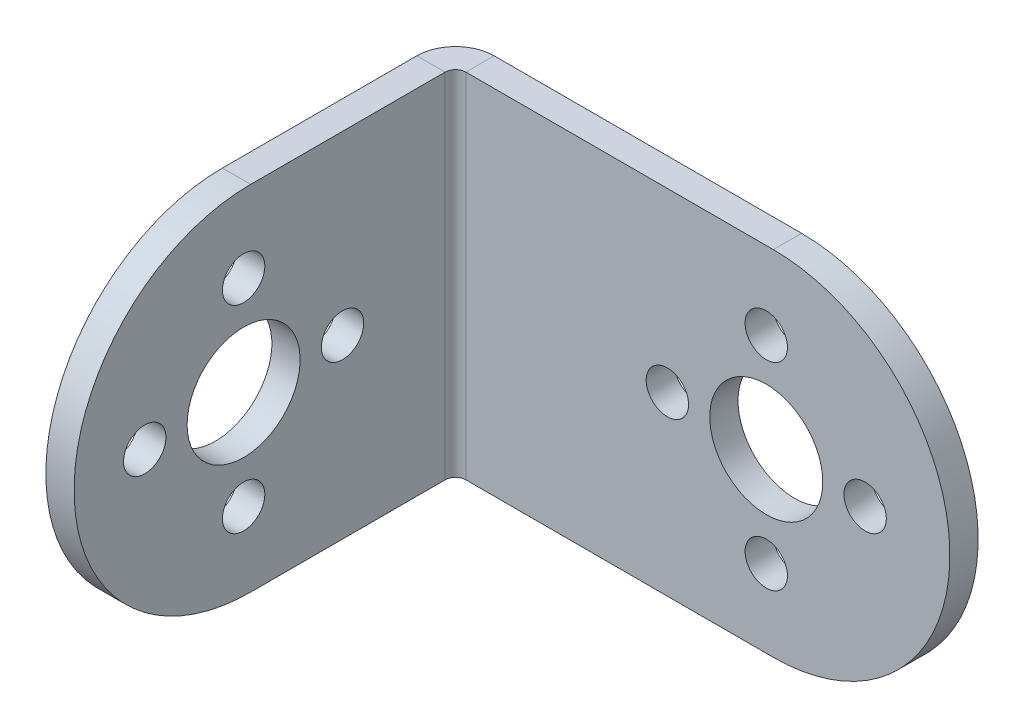
ISO-10303-21;
HEADER;
FILE_DESCRIPTION(('STEP AP214'),'2;1');
FILE_NAME('part.step','',(''),(''),'','','');
FILE_SCHEMA(('AUTOMOTIVE_DESIGN { 1 0 10303 214 1 1 1 1 }'));
ENDSEC;
DATA;
#1=APPLICATION_CONTEXT('core data for automotive mechanical design processes');
#2=APPLICATION_PROTOCOL_DEFINITION('international standard','automotive_design',2000,#1);
#3=PRODUCT_CONTEXT('',#1,'mechanical');
#4=PRODUCT('Part','Part','',(#3));
#5=PRODUCT_RELATED_PRODUCT_CATEGORY('part','',(#4));
#6=PRODUCT_DEFINITION_FORMATION('','',#4);
#7=PRODUCT_DEFINITION_CONTEXT('part definition',#1,'design');
#8=PRODUCT_DEFINITION('design','',#6,#7);
#9=PRODUCT_DEFINITION_SHAPE('','',#8);
#10=(LENGTH_UNIT() NAMED_UNIT(*) SI_UNIT(.MILLI.,.METRE.));
#11=(NAMED_UNIT(*) PLANE_ANGLE_UNIT() SI_UNIT($,.RADIAN.));
#12=(NAMED_UNIT(*) SI_UNIT($,.STERADIAN.) SOLID_ANGLE_UNIT());
#13=UNCERTAINTY_MEASURE_WITH_UNIT(LENGTH_MEASURE(1.E-05),#10,'distance_accuracy_value','');
#14=(GEOMETRIC_REPRESENTATION_CONTEXT(3) GLOBAL_UNCERTAINTY_ASSIGNED_CONTEXT((#13)) GLOBAL_UNIT_ASSIGNED_CONTEXT((#10,
#11,#12)) REPRESENTATION_CONTEXT('',''));
#15=CARTESIAN_POINT('',(0.,0.,0.));
#16=DIRECTION('',(0.,0.,1.));
#17=DIRECTION('',(1.,0.,0.));
#18=AXIS2_PLACEMENT_3D('',#15,#16,#17);
#19=CARTESIAN_POINT('',(0.,0.,0.));
#20=DIRECTION('',(-1.,0.,0.));
#21=DIRECTION('',(0.,0.,1.));
#22=AXIS2_PLACEMENT_3D('',#19,#20,#21);
#23=PLANE('',#22);
#24=CARTESIAN_POINT('',(0.,-5.5,15.));
#25=DIRECTION('',(-1.,0.,0.));
#26=DIRECTION('',(0.,0.,1.));
#27=AXIS2_PLACEMENT_3D('',#24,#25,#26);
#28=CIRCLE('',#27,1.5);
#29=CARTESIAN_POINT('',(0.,-5.5,16.5));
#30=VERTEX_POINT('',#29);
#31=EDGE_CURVE('E135',#30,#30,#28,.T.);
#32=ORIENTED_EDGE('',*,*,#31,.F.);
#33=EDGE_LOOP('',(#32));
#34=FACE_BOUND('',#33,.T.);
#35=CARTESIAN_POINT('',(0.,-12.5,7.99999999999999));
#36=DIRECTION('',(-1.,0.,0.));
#37=DIRECTION('',(0.,0.,1.));
#38=AXIS2_PLACEMENT_3D('',#35,#36,#37);
#39=CIRCLE('',#38,1.5);
#40=CARTESIAN_POINT('',(0.,-12.5,9.49999999999999));
#41=VERTEX_POINT('',#40);
#42=EDGE_CURVE('E531',#41,#41,#39,.T.);
#43=ORIENTED_EDGE('',*,*,#42,.F.);
#44=EDGE_LOOP('',(#43));
#45=FACE_BOUND('',#44,.T.);
#46=CARTESIAN_POINT('',(0.,-12.5,15.));
#47=DIRECTION('',(-1.,0.,0.));
#48=DIRECTION('',(0.,0.,1.));
#49=AXIS2_PLACEMENT_3D('',#46,#47,#48);
#50=CIRCLE('',#49,4.);
#51=CARTESIAN_POINT('',(0.,-12.5,19.));
#52=VERTEX_POINT('',#51);
#53=EDGE_CURVE('E147',#52,#52,#50,.T.);
#54=ORIENTED_EDGE('',*,*,#53,.F.);
#55=EDGE_LOOP('',(#54));
#56=FACE_BOUND('',#55,.T.);
#57=CARTESIAN_POINT('',(0.,-12.5,22.));
#58=DIRECTION('',(-1.,0.,0.));
#59=DIRECTION('',(0.,0.,1.));
#60=AXIS2_PLACEMENT_3D('',#57,#58,#59);
#61=CIRCLE('',#60,1.5);
#62=CARTESIAN_POINT('',(0.,-12.5,23.5));
#63=VERTEX_POINT('',#62);
#64=EDGE_CURVE('E537',#63,#63,#61,.T.);
#65=ORIENTED_EDGE('',*,*,#64,.F.);
#66=EDGE_LOOP('',(#65));
#67=FACE_BOUND('',#66,.T.);
#68=CARTESIAN_POINT('',(0.,-19.5,15.));
#69=DIRECTION('',(-1.,0.,0.));
#70=DIRECTION('',(0.,0.,1.));
#71=AXIS2_PLACEMENT_3D('',#68,#69,#70);
#72=CIRCLE('',#71,1.5);
#73=CARTESIAN_POINT('',(0.,-19.5,16.5));
#74=VERTEX_POINT('',#73);
#75=EDGE_CURVE('E524',#74,#74,#72,.T.);
#76=ORIENTED_EDGE('',*,*,#75,.F.);
#77=EDGE_LOOP('',(#76));
#78=FACE_BOUND('',#77,.T.);
#79=DIRECTION('',(0.,0.,-1.));
#80=VECTOR('',#79,1.);
#81=CARTESIAN_POINT('',(0.,-25.,0.));
#82=LINE('',#81,#80);
#83=CARTESIAN_POINT('',(0.,-25.,14.5));
#84=VERTEX_POINT('',#83);
#85=CARTESIAN_POINT('',(0.,-25.,0.73659999999999));
#86=VERTEX_POINT('',#85);
#87=EDGE_CURVE('E132',#84,#86,#82,.T.);
#88=ORIENTED_EDGE('',*,*,#87,.F.);
#89=CARTESIAN_POINT('',(0.,-12.5,14.5));
#90=DIRECTION('',(-1.,0.,0.));
#91=DIRECTION('',(0.,0.,1.));
#92=AXIS2_PLACEMENT_3D('',#89,#90,#91);
#93=CIRCLE('',#92,12.5);
#94=CARTESIAN_POINT('',(0.,0.,14.5));
#95=VERTEX_POINT('',#94);
#96=EDGE_CURVE('E118',#95,#84,#93,.F.);
#97=ORIENTED_EDGE('',*,*,#96,.F.);
#98=DIRECTION('',(0.,0.,1.));
#99=VECTOR('',#98,1.);
#100=CARTESIAN_POINT('',(0.,0.,28.));
#101=LINE('',#100,#99);
#102=CARTESIAN_POINT('',(0.,0.,0.73659999999999));
#103=VERTEX_POINT('',#102);
#104=EDGE_CURVE('E140',#103,#95,#101,.T.);
#105=ORIENTED_EDGE('',*,*,#104,.F.);
#106=DIRECTION('',(0.,-1.,0.));
#107=VECTOR('',#106,1.);
#108=CARTESIAN_POINT('',(0.,0.,0.73659999999999));
#109=LINE('',#108,#107);
#110=EDGE_CURVE('E138',#103,#86,#109,.T.);
#111=ORIENTED_EDGE('',*,*,#110,.T.);
#112=EDGE_LOOP('',(#88,#97,#105,#111));
#113=FACE_BOUND('',#112,.T.);
#114=ADVANCED_FACE('F56',(#34,#45,#56,#67,#78,#113),#23,.T.);
#115=CARTESIAN_POINT('',(2.,0.,0.));
#116=DIRECTION('',(-1.,0.,0.));
#117=DIRECTION('',(0.,0.,1.));
#118=AXIS2_PLACEMENT_3D('',#115,#116,#117);
#119=PLANE('',#118);
#120=CARTESIAN_POINT('',(1.99999999999995,-5.5,15.));
#121=DIRECTION('',(-1.,0.,0.));
#122=DIRECTION('',(0.,0.,1.));
#123=AXIS2_PLACEMENT_3D('',#120,#121,#122);
#124=CIRCLE('',#123,1.5);
#125=CARTESIAN_POINT('',(1.99999999999994,-5.5,16.5));
#126=VERTEX_POINT('',#125);
#127=EDGE_CURVE('E521',#126,#126,#124,.T.);
#128=ORIENTED_EDGE('',*,*,#127,.T.);
#129=EDGE_LOOP('',(#128));
#130=FACE_BOUND('',#129,.T.);
#131=CARTESIAN_POINT('',(1.99999999999997,-12.5,8.));
#132=DIRECTION('',(-1.,0.,0.));
#133=DIRECTION('',(0.,0.,1.));
#134=AXIS2_PLACEMENT_3D('',#131,#132,#133);
#135=CIRCLE('',#134,1.5);
#136=CARTESIAN_POINT('',(1.99999999999997,-12.5,9.5));
#137=VERTEX_POINT('',#136);
#138=EDGE_CURVE('E534',#137,#137,#135,.T.);
#139=ORIENTED_EDGE('',*,*,#138,.T.);
#140=EDGE_LOOP('',(#139));
#141=FACE_BOUND('',#140,.T.);
#142=CARTESIAN_POINT('',(1.99999999999995,-12.5,15.));
#143=DIRECTION('',(-1.,0.,0.));
#144=DIRECTION('',(0.,0.,1.));
#145=AXIS2_PLACEMENT_3D('',#142,#143,#144);
#146=CIRCLE('',#145,4.);
#147=CARTESIAN_POINT('',(1.99999999999993,-12.5,19.));
#148=VERTEX_POINT('',#147);
#149=EDGE_CURVE('E164',#148,#148,#146,.T.);
#150=ORIENTED_EDGE('',*,*,#149,.T.);
#151=EDGE_LOOP('',(#150));
#152=FACE_BOUND('',#151,.T.);
#153=CARTESIAN_POINT('',(1.99999999999992,-12.5,22.));
#154=DIRECTION('',(-1.,0.,0.));
#155=DIRECTION('',(0.,0.,1.));
#156=AXIS2_PLACEMENT_3D('',#153,#154,#155);
#157=CIRCLE('',#156,1.5);
#158=CARTESIAN_POINT('',(1.99999999999992,-12.5,23.5));
#159=VERTEX_POINT('',#158);
#160=EDGE_CURVE('E540',#159,#159,#157,.T.);
#161=ORIENTED_EDGE('',*,*,#160,.T.);
#162=EDGE_LOOP('',(#161));
#163=FACE_BOUND('',#162,.T.);
#164=CARTESIAN_POINT('',(1.99999999999995,-19.5,15.));
#165=DIRECTION('',(-1.,0.,0.));
#166=DIRECTION('',(0.,0.,1.));
#167=AXIS2_PLACEMENT_3D('',#164,#165,#166);
#168=CIRCLE('',#167,1.5);
#169=CARTESIAN_POINT('',(1.99999999999994,-19.5,16.5));
#170=VERTEX_POINT('',#169);
#171=EDGE_CURVE('E528',#170,#170,#168,.T.);
#172=ORIENTED_EDGE('',*,*,#171,.T.);
#173=EDGE_LOOP('',(#172));
#174=FACE_BOUND('',#173,.T.);
#175=CARTESIAN_POINT('',(1.99999999999995,-12.5,14.5));
#176=DIRECTION('',(-1.,0.,0.));
#177=DIRECTION('',(0.,0.,1.));
#178=AXIS2_PLACEMENT_3D('',#175,#176,#177);
#179=CIRCLE('',#178,12.5);
#180=CARTESIAN_POINT('',(1.99999999999995,0.,14.5));
#181=VERTEX_POINT('',#180);
#182=CARTESIAN_POINT('',(1.99999999999995,-25.,14.5));
#183=VERTEX_POINT('',#182);
#184=EDGE_CURVE('E71',#181,#183,#179,.F.);
#185=ORIENTED_EDGE('',*,*,#184,.T.);
#186=DIRECTION('',(0.,0.,1.));
#187=VECTOR('',#186,1.);
#188=CARTESIAN_POINT('',(2.,-25.,0.));
#189=LINE('',#188,#187);
#190=CARTESIAN_POINT('',(2.,-25.,0.736599999999997));
#191=VERTEX_POINT('',#190);
#192=EDGE_CURVE('E134',#183,#191,#189,.F.);
#193=ORIENTED_EDGE('',*,*,#192,.T.);
#194=DIRECTION('',(0.,1.,0.));
#195=VECTOR('',#194,1.);
#196=CARTESIAN_POINT('',(2.,0.,0.736599999999997));
#197=LINE('',#196,#195);
#198=CARTESIAN_POINT('',(2.,0.,0.736599999999997));
#199=VERTEX_POINT('',#198);
#200=EDGE_CURVE('E158',#199,#191,#197,.F.);
#201=ORIENTED_EDGE('',*,*,#200,.F.);
#202=DIRECTION('',(0.,0.,-1.));
#203=VECTOR('',#202,1.);
#204=CARTESIAN_POINT('',(2.,0.,0.));
#205=LINE('',#204,#203);
#206=EDGE_CURVE('E151',#199,#181,#205,.F.);
#207=ORIENTED_EDGE('',*,*,#206,.T.);
#208=EDGE_LOOP('',(#185,#193,#201,#207));
#209=FACE_BOUND('',#208,.T.);
#210=ADVANCED_FACE('F259',(#130,#141,#152,#163,#174,#209),#119,.F.);
#211=CARTESIAN_POINT('',(0.,-25.,0.));
#212=DIRECTION('',(0.,-1.,0.));
#213=DIRECTION('',(0.,0.,-1.));
#214=AXIS2_PLACEMENT_3D('',#211,#212,#213);
#215=PLANE('',#214);
#216=ORIENTED_EDGE('',*,*,#192,.F.);
#217=DIRECTION('',(1.,0.,0.));
#218=VECTOR('',#217,1.);
#219=CARTESIAN_POINT('',(1.99999999999995,-25.,14.5));
#220=LINE('',#219,#218);
#221=EDGE_CURVE('E121',#183,#84,#220,.F.);
#222=ORIENTED_EDGE('',*,*,#221,.T.);
#223=ORIENTED_EDGE('',*,*,#87,.T.);
#224=DIRECTION('',(-1.,0.,0.));
#225=VECTOR('',#224,1.);
#226=CARTESIAN_POINT('',(2.,-25.,0.736599999999997));
#227=LINE('',#226,#225);
#228=EDGE_CURVE('E155',#191,#86,#227,.T.);
#229=ORIENTED_EDGE('',*,*,#228,.F.);
#230=EDGE_LOOP('',(#216,#222,#223,#229));
#231=FACE_BOUND('',#230,.T.);
#232=ADVANCED_FACE('F130',(#231),#215,.T.);
#233=CARTESIAN_POINT('',(0.,-25.,-2.));
#234=DIRECTION('',(0.,-1.,0.));
#235=DIRECTION('',(1.,0.,0.));
#236=AXIS2_PLACEMENT_3D('',#233,#234,#235);
#237=PLANE('',#236);
#238=DIRECTION('',(1.,0.,0.));
#239=VECTOR('',#238,1.);
#240=CARTESIAN_POINT('',(0.,-25.,0.));
#241=LINE('',#240,#239);
#242=CARTESIAN_POINT('',(2.7366,-25.,0.));
#243=VERTEX_POINT('',#242);
#244=CARTESIAN_POINT('',(24.5,-25.,0.));
#245=VERTEX_POINT('',#244);
#246=EDGE_CURVE('E223',#243,#245,#241,.T.);
#247=ORIENTED_EDGE('',*,*,#246,.F.);
#248=DIRECTION('',(0.,0.,-1.));
#249=VECTOR('',#248,1.);
#250=CARTESIAN_POINT('',(2.7366,-25.,0.));
#251=LINE('',#250,#249);
#252=CARTESIAN_POINT('',(2.7366,-25.,-2.));
#253=VERTEX_POINT('',#252);
#254=EDGE_CURVE('E170',#243,#253,#251,.T.);
#255=ORIENTED_EDGE('',*,*,#254,.T.);
#256=DIRECTION('',(1.,0.,0.));
#257=VECTOR('',#256,1.);
#258=CARTESIAN_POINT('',(0.,-25.,-2.));
#259=LINE('',#258,#257);
#260=CARTESIAN_POINT('',(24.5,-25.,-2.));
#261=VERTEX_POINT('',#260);
#262=EDGE_CURVE('E215',#253,#261,#259,.T.);
#263=ORIENTED_EDGE('',*,*,#262,.T.);
#264=DIRECTION('',(0.,0.,1.));
#265=VECTOR('',#264,1.);
#266=CARTESIAN_POINT('',(24.5,-25.,-2.));
#267=LINE('',#266,#265);
#268=EDGE_CURVE('E60',#261,#245,#267,.T.);
#269=ORIENTED_EDGE('',*,*,#268,.T.);
#270=EDGE_LOOP('',(#247,#255,#263,#269));
#271=FACE_BOUND('',#270,.T.);
#272=ADVANCED_FACE('F251',(#271),#237,.T.);
#273=CARTESIAN_POINT('',(24.5,-12.5,-2.));
#274=DIRECTION('',(0.,0.,-1.));
#275=DIRECTION('',(-1.,0.,0.));
#276=AXIS2_PLACEMENT_3D('',#273,#274,#275);
#277=PLANE('',#276);
#278=CARTESIAN_POINT('',(24.,-12.5,-2.));
#279=DIRECTION('',(0.,0.,1.));
#280=DIRECTION('',(1.,0.,0.));
#281=AXIS2_PLACEMENT_3D('',#278,#279,#280);
#282=CIRCLE('',#281,4.);
#283=CARTESIAN_POINT('',(28.,-12.5,-2.));
#284=VERTEX_POINT('',#283);
#285=EDGE_CURVE('E206',#284,#284,#282,.T.);
#286=ORIENTED_EDGE('',*,*,#285,.T.);
#287=EDGE_LOOP('',(#286));
#288=FACE_BOUND('',#287,.T.);
#289=CARTESIAN_POINT('',(17.,-12.5,-2.));
#290=DIRECTION('',(0.,0.,1.));
#291=DIRECTION('',(1.,0.,0.));
#292=AXIS2_PLACEMENT_3D('',#289,#290,#291);
#293=CIRCLE('',#292,1.5);
#294=CARTESIAN_POINT('',(18.5,-12.5,-2.));
#295=VERTEX_POINT('',#294);
#296=EDGE_CURVE('E200',#295,#295,#293,.T.);
#297=ORIENTED_EDGE('',*,*,#296,.T.);
#298=EDGE_LOOP('',(#297));
#299=FACE_BOUND('',#298,.T.);
#300=CARTESIAN_POINT('',(31.,-12.5,-2.));
#301=DIRECTION('',(0.,0.,1.));
#302=DIRECTION('',(1.,0.,0.));
#303=AXIS2_PLACEMENT_3D('',#300,#301,#302);
#304=CIRCLE('',#303,1.5);
#305=CARTESIAN_POINT('',(32.5,-12.5,-2.));
#306=VERTEX_POINT('',#305);
#307=EDGE_CURVE('E194',#306,#306,#304,.T.);
#308=ORIENTED_EDGE('',*,*,#307,.T.);
#309=EDGE_LOOP('',(#308));
#310=FACE_BOUND('',#309,.T.);
#311=CARTESIAN_POINT('',(24.,-19.5,-2.));
#312=DIRECTION('',(0.,0.,1.));
#313=DIRECTION('',(1.,0.,0.));
#314=AXIS2_PLACEMENT_3D('',#311,#312,#313);
#315=CIRCLE('',#314,1.5);
#316=CARTESIAN_POINT('',(25.5,-19.5,-2.));
#317=VERTEX_POINT('',#316);
#318=EDGE_CURVE('E188',#317,#317,#315,.T.);
#319=ORIENTED_EDGE('',*,*,#318,.T.);
#320=EDGE_LOOP('',(#319));
#321=FACE_BOUND('',#320,.T.);
#322=CARTESIAN_POINT('',(24.,-5.5,-2.));
#323=DIRECTION('',(0.,0.,1.));
#324=DIRECTION('',(1.,0.,0.));
#325=AXIS2_PLACEMENT_3D('',#322,#323,#324);
#326=CIRCLE('',#325,1.5);
#327=CARTESIAN_POINT('',(25.5,-5.5,-2.));
#328=VERTEX_POINT('',#327);
#329=EDGE_CURVE('E182',#328,#328,#326,.T.);
#330=ORIENTED_EDGE('',*,*,#329,.T.);
#331=EDGE_LOOP('',(#330));
#332=FACE_BOUND('',#331,.T.);
#333=ORIENTED_EDGE('',*,*,#262,.F.);
#334=DIRECTION('',(0.,-1.,0.));
#335=VECTOR('',#334,1.);
#336=CARTESIAN_POINT('',(2.7366,-25.,-2.));
#337=LINE('',#336,#335);
#338=CARTESIAN_POINT('',(2.7366,0.,-2.));
#339=VERTEX_POINT('',#338);
#340=EDGE_CURVE('E165',#253,#339,#337,.F.);
#341=ORIENTED_EDGE('',*,*,#340,.T.);
#342=DIRECTION('',(-1.,0.,0.));
#343=VECTOR('',#342,1.);
#344=CARTESIAN_POINT('',(0.,0.,-2.));
#345=LINE('',#344,#343);
#346=CARTESIAN_POINT('',(24.5,0.,-2.));
#347=VERTEX_POINT('',#346);
#348=EDGE_CURVE('E212',#347,#339,#345,.T.);
#349=ORIENTED_EDGE('',*,*,#348,.F.);
#350=CARTESIAN_POINT('',(24.5,-12.5,-2.));
#351=DIRECTION('',(0.,0.,1.));
#352=DIRECTION('',(-1.,0.,0.));
#353=AXIS2_PLACEMENT_3D('',#350,#351,#352);
#354=CIRCLE('',#353,12.5);
#355=EDGE_CURVE('E218',#261,#347,#354,.T.);
#356=ORIENTED_EDGE('',*,*,#355,.F.);
#357=EDGE_LOOP('',(#333,#341,#349,#356));
#358=FACE_BOUND('',#357,.T.);
#359=ADVANCED_FACE('F245',(#288,#299,#310,#321,#332,#358),#277,.T.);
#360=CARTESIAN_POINT('',(24.5,-12.5,0.));
#361=DIRECTION('',(0.,0.,-1.));
#362=DIRECTION('',(-1.,0.,0.));
#363=AXIS2_PLACEMENT_3D('',#360,#361,#362);
#364=PLANE('',#363);
#365=CARTESIAN_POINT('',(24.,-12.5,0.));
#366=DIRECTION('',(0.,0.,1.));
#367=DIRECTION('',(1.,0.,0.));
#368=AXIS2_PLACEMENT_3D('',#365,#366,#367);
#369=CIRCLE('',#368,4.);
#370=CARTESIAN_POINT('',(28.,-12.5,0.));
#371=VERTEX_POINT('',#370);
#372=EDGE_CURVE('E203',#371,#371,#369,.T.);
#373=ORIENTED_EDGE('',*,*,#372,.F.);
#374=EDGE_LOOP('',(#373));
#375=FACE_BOUND('',#374,.T.);
#376=CARTESIAN_POINT('',(17.,-12.5,0.));
#377=DIRECTION('',(0.,0.,1.));
#378=DIRECTION('',(1.,0.,0.));
#379=AXIS2_PLACEMENT_3D('',#376,#377,#378);
#380=CIRCLE('',#379,1.5);
#381=CARTESIAN_POINT('',(18.5,-12.5,0.));
#382=VERTEX_POINT('',#381);
#383=EDGE_CURVE('E197',#382,#382,#380,.T.);
#384=ORIENTED_EDGE('',*,*,#383,.F.);
#385=EDGE_LOOP('',(#384));
#386=FACE_BOUND('',#385,.T.);
#387=CARTESIAN_POINT('',(31.,-12.5,0.));
#388=DIRECTION('',(0.,0.,1.));
#389=DIRECTION('',(1.,0.,0.));
#390=AXIS2_PLACEMENT_3D('',#387,#388,#389);
#391=CIRCLE('',#390,1.5);
#392=CARTESIAN_POINT('',(32.5,-12.5,0.));
#393=VERTEX_POINT('',#392);
#394=EDGE_CURVE('E191',#393,#393,#391,.T.);
#395=ORIENTED_EDGE('',*,*,#394,.F.);
#396=EDGE_LOOP('',(#395));
#397=FACE_BOUND('',#396,.T.);
#398=CARTESIAN_POINT('',(24.,-19.5,0.));
#399=DIRECTION('',(0.,0.,1.));
#400=DIRECTION('',(1.,0.,0.));
#401=AXIS2_PLACEMENT_3D('',#398,#399,#400);
#402=CIRCLE('',#401,1.5);
#403=CARTESIAN_POINT('',(25.5,-19.5,0.));
#404=VERTEX_POINT('',#403);
#405=EDGE_CURVE('E185',#404,#404,#402,.T.);
#406=ORIENTED_EDGE('',*,*,#405,.F.);
#407=EDGE_LOOP('',(#406));
#408=FACE_BOUND('',#407,.T.);
#409=CARTESIAN_POINT('',(24.,-5.5,0.));
#410=DIRECTION('',(0.,0.,1.));
#411=DIRECTION('',(1.,0.,0.));
#412=AXIS2_PLACEMENT_3D('',#409,#410,#411);
#413=CIRCLE('',#412,1.5);
#414=CARTESIAN_POINT('',(25.5,-5.5,0.));
#415=VERTEX_POINT('',#414);
#416=EDGE_CURVE('E179',#415,#415,#413,.T.);
#417=ORIENTED_EDGE('',*,*,#416,.F.);
#418=EDGE_LOOP('',(#417));
#419=FACE_BOUND('',#418,.T.);
#420=DIRECTION('',(0.,-1.,0.));
#421=VECTOR('',#420,1.);
#422=CARTESIAN_POINT('',(2.7366,-25.,0.));
#423=LINE('',#422,#421);
#424=CARTESIAN_POINT('',(2.7366,0.,0.));
#425=VERTEX_POINT('',#424);
#426=EDGE_CURVE('E143',#243,#425,#423,.F.);
#427=ORIENTED_EDGE('',*,*,#426,.F.);
#428=ORIENTED_EDGE('',*,*,#246,.T.);
#429=CARTESIAN_POINT('',(24.5,-12.5,0.));
#430=DIRECTION('',(0.,0.,1.));
#431=DIRECTION('',(-1.,0.,0.));
#432=AXIS2_PLACEMENT_3D('',#429,#430,#431);
#433=CIRCLE('',#432,12.5);
#434=CARTESIAN_POINT('',(24.5,0.,0.));
#435=VERTEX_POINT('',#434);
#436=EDGE_CURVE('E216',#245,#435,#433,.T.);
#437=ORIENTED_EDGE('',*,*,#436,.T.);
#438=DIRECTION('',(-1.,0.,0.));
#439=VECTOR('',#438,1.);
#440=CARTESIAN_POINT('',(0.,0.,0.));
#441=LINE('',#440,#439);
#442=EDGE_CURVE('E209',#435,#425,#441,.T.);
#443=ORIENTED_EDGE('',*,*,#442,.T.);
#444=EDGE_LOOP('',(#427,#428,#437,#443));
#445=FACE_BOUND('',#444,.T.);
#446=ADVANCED_FACE('F229',(#375,#386,#397,#408,#419,#445),#364,.F.);
#447=CARTESIAN_POINT('',(0.,0.,-2.));
#448=DIRECTION('',(0.,1.,0.));
#449=DIRECTION('',(0.,0.,1.));
#450=AXIS2_PLACEMENT_3D('',#447,#448,#449);
#451=PLANE('',#450);
#452=DIRECTION('',(0.,0.,-1.));
#453=VECTOR('',#452,1.);
#454=CARTESIAN_POINT('',(2.7366,0.,0.));
#455=LINE('',#454,#453);
#456=EDGE_CURVE('E177',#425,#339,#455,.T.);
#457=ORIENTED_EDGE('',*,*,#456,.F.);
#458=ORIENTED_EDGE('',*,*,#442,.F.);
#459=DIRECTION('',(0.,0.,1.));
#460=VECTOR('',#459,1.);
#461=CARTESIAN_POINT('',(24.5,0.,-2.));
#462=LINE('',#461,#460);
#463=EDGE_CURVE('E13',#347,#435,#462,.T.);
#464=ORIENTED_EDGE('',*,*,#463,.F.);
#465=ORIENTED_EDGE('',*,*,#348,.T.);
#466=EDGE_LOOP('',(#457,#458,#464,#465));
#467=FACE_BOUND('',#466,.T.);
#468=ADVANCED_FACE('F58',(#467),#451,.T.);
#469=CARTESIAN_POINT('',(24.5,-12.5,-2.));
#470=DIRECTION('',(0.,0.,1.));
#471=DIRECTION('',(1.,0.,0.));
#472=AXIS2_PLACEMENT_3D('',#469,#470,#471);
#473=CYLINDRICAL_SURFACE('',#472,12.5);
#474=ORIENTED_EDGE('',*,*,#436,.F.);
#475=ORIENTED_EDGE('',*,*,#268,.F.);
#476=ORIENTED_EDGE('',*,*,#355,.T.);
#477=ORIENTED_EDGE('',*,*,#463,.T.);
#478=EDGE_LOOP('',(#474,#475,#476,#477));
#479=FACE_BOUND('',#478,.T.);
#480=ADVANCED_FACE('F236',(#479),#473,.T.);
#481=CARTESIAN_POINT('',(24.,-12.5,-2.));
#482=DIRECTION('',(0.,0.,1.));
#483=DIRECTION('',(1.,0.,0.));
#484=AXIS2_PLACEMENT_3D('',#481,#482,#483);
#485=CYLINDRICAL_SURFACE('',#484,4.);
#486=ORIENTED_EDGE('',*,*,#285,.F.);
#487=EDGE_LOOP('',(#486));
#488=FACE_BOUND('',#487,.T.);
#489=ORIENTED_EDGE('',*,*,#372,.T.);
#490=EDGE_LOOP('',(#489));
#491=FACE_BOUND('',#490,.T.);
#492=ADVANCED_FACE('F305',(#488,#491),#485,.F.);
#493=CARTESIAN_POINT('',(17.,-12.5,-2.));
#494=DIRECTION('',(0.,0.,1.));
#495=DIRECTION('',(1.,0.,0.));
#496=AXIS2_PLACEMENT_3D('',#493,#494,#495);
#497=CYLINDRICAL_SURFACE('',#496,1.5);
#498=ORIENTED_EDGE('',*,*,#296,.F.);
#499=EDGE_LOOP('',(#498));
#500=FACE_BOUND('',#499,.T.);
#501=ORIENTED_EDGE('',*,*,#383,.T.);
#502=EDGE_LOOP('',(#501));
#503=FACE_BOUND('',#502,.T.);
#504=ADVANCED_FACE('F301',(#500,#503),#497,.F.);
#505=CARTESIAN_POINT('',(31.,-12.5,-2.));
#506=DIRECTION('',(0.,0.,1.));
#507=DIRECTION('',(1.,0.,0.));
#508=AXIS2_PLACEMENT_3D('',#505,#506,#507);
#509=CYLINDRICAL_SURFACE('',#508,1.5);
#510=ORIENTED_EDGE('',*,*,#307,.F.);
#511=EDGE_LOOP('',(#510));
#512=FACE_BOUND('',#511,.T.);
#513=ORIENTED_EDGE('',*,*,#394,.T.);
#514=EDGE_LOOP('',(#513));
#515=FACE_BOUND('',#514,.T.);
#516=ADVANCED_FACE('F297',(#512,#515),#509,.F.);
#517=CARTESIAN_POINT('',(24.,-19.5,-2.));
#518=DIRECTION('',(0.,0.,1.));
#519=DIRECTION('',(1.,0.,0.));
#520=AXIS2_PLACEMENT_3D('',#517,#518,#519);
#521=CYLINDRICAL_SURFACE('',#520,1.5);
#522=ORIENTED_EDGE('',*,*,#318,.F.);
#523=EDGE_LOOP('',(#522));
#524=FACE_BOUND('',#523,.T.);
#525=ORIENTED_EDGE('',*,*,#405,.T.);
#526=EDGE_LOOP('',(#525));
#527=FACE_BOUND('',#526,.T.);
#528=ADVANCED_FACE('F293',(#524,#527),#521,.F.);
#529=CARTESIAN_POINT('',(24.,-5.5,-2.));
#530=DIRECTION('',(0.,0.,1.));
#531=DIRECTION('',(1.,0.,0.));
#532=AXIS2_PLACEMENT_3D('',#529,#530,#531);
#533=CYLINDRICAL_SURFACE('',#532,1.5);
#534=ORIENTED_EDGE('',*,*,#329,.F.);
#535=EDGE_LOOP('',(#534));
#536=FACE_BOUND('',#535,.T.);
#537=ORIENTED_EDGE('',*,*,#416,.T.);
#538=EDGE_LOOP('',(#537));
#539=FACE_BOUND('',#538,.T.);
#540=ADVANCED_FACE('F288',(#536,#539),#533,.F.);
#541=CARTESIAN_POINT('',(2.7366,0.,0.7366));
#542=DIRECTION('',(0.,1.,0.));
#543=DIRECTION('',(0.,0.,1.));
#544=AXIS2_PLACEMENT_3D('',#541,#542,#543);
#545=PLANE('',#544);
#546=DIRECTION('',(-1.,0.,0.));
#547=VECTOR('',#546,1.);
#548=CARTESIAN_POINT('',(0.,0.,0.73659999999999));
#549=LINE('',#548,#547);
#550=EDGE_CURVE('E161',#199,#103,#549,.T.);
#551=ORIENTED_EDGE('',*,*,#550,.F.);
#552=CARTESIAN_POINT('',(2.7366,0.,0.7366));
#553=DIRECTION('',(0.,-1.,0.));
#554=DIRECTION('',(0.,0.,-1.));
#555=AXIS2_PLACEMENT_3D('',#552,#553,#554);
#556=CIRCLE('',#555,0.7366);
#557=EDGE_CURVE('E173',#425,#199,#556,.F.);
#558=ORIENTED_EDGE('',*,*,#557,.F.);
#559=ORIENTED_EDGE('',*,*,#456,.T.);
#560=CARTESIAN_POINT('',(2.7366,0.,0.7366));
#561=DIRECTION('',(0.,-1.,0.));
#562=DIRECTION('',(0.,0.,-1.));
#563=AXIS2_PLACEMENT_3D('',#560,#561,#562);
#564=CIRCLE('',#563,2.7366);
#565=EDGE_CURVE('E79',#339,#103,#564,.F.);
#566=ORIENTED_EDGE('',*,*,#565,.T.);
#567=EDGE_LOOP('',(#551,#558,#559,#566));
#568=FACE_BOUND('',#567,.T.);
#569=ADVANCED_FACE('F242',(#568),#545,.T.);
#570=CARTESIAN_POINT('',(2.7366,-25.,0.7366));
#571=DIRECTION('',(0.,1.,0.));
#572=DIRECTION('',(0.,0.,1.));
#573=AXIS2_PLACEMENT_3D('',#570,#571,#572);
#574=PLANE('',#573);
#575=CARTESIAN_POINT('',(2.7366,-25.,0.7366));
#576=DIRECTION('',(0.,-1.,0.));
#577=DIRECTION('',(0.,0.,-1.));
#578=AXIS2_PLACEMENT_3D('',#575,#576,#577);
#579=CIRCLE('',#578,0.7366);
#580=EDGE_CURVE('E139',#191,#243,#579,.T.);
#581=ORIENTED_EDGE('',*,*,#580,.F.);
#582=ORIENTED_EDGE('',*,*,#228,.T.);
#583=CARTESIAN_POINT('',(2.7366,-25.,0.7366));
#584=DIRECTION('',(0.,-1.,0.));
#585=DIRECTION('',(0.,0.,-1.));
#586=AXIS2_PLACEMENT_3D('',#583,#584,#585);
#587=CIRCLE('',#586,2.7366);
#588=EDGE_CURVE('E168',#86,#253,#587,.T.);
#589=ORIENTED_EDGE('',*,*,#588,.T.);
#590=ORIENTED_EDGE('',*,*,#254,.F.);
#591=EDGE_LOOP('',(#581,#582,#589,#590));
#592=FACE_BOUND('',#591,.T.);
#593=ADVANCED_FACE('F249',(#592),#574,.F.);
#594=CARTESIAN_POINT('',(2.7366,-25.,0.7366));
#595=DIRECTION('',(0.,-1.,0.));
#596=DIRECTION('',(-1.,0.,0.));
#597=AXIS2_PLACEMENT_3D('',#594,#595,#596);
#598=CYLINDRICAL_SURFACE('',#597,2.7366);
#599=ORIENTED_EDGE('',*,*,#340,.F.);
#600=ORIENTED_EDGE('',*,*,#588,.F.);
#601=ORIENTED_EDGE('',*,*,#110,.F.);
#602=ORIENTED_EDGE('',*,*,#565,.F.);
#603=EDGE_LOOP('',(#599,#600,#601,#602));
#604=FACE_BOUND('',#603,.T.);
#605=ADVANCED_FACE('F246',(#604),#598,.T.);
#606=CARTESIAN_POINT('',(2.7366,-25.,0.7366));
#607=DIRECTION('',(0.,-1.,0.));
#608=DIRECTION('',(-1.,0.,0.));
#609=AXIS2_PLACEMENT_3D('',#606,#607,#608);
#610=CYLINDRICAL_SURFACE('',#609,0.7366);
#611=ORIENTED_EDGE('',*,*,#426,.T.);
#612=ORIENTED_EDGE('',*,*,#557,.T.);
#613=ORIENTED_EDGE('',*,*,#200,.T.);
#614=ORIENTED_EDGE('',*,*,#580,.T.);
#615=EDGE_LOOP('',(#611,#612,#613,#614));
#616=FACE_BOUND('',#615,.T.);
#617=ADVANCED_FACE('F279',(#616),#610,.F.);
#618=CARTESIAN_POINT('',(0.,0.,28.));
#619=DIRECTION('',(0.,1.,0.));
#620=DIRECTION('',(0.,0.,1.));
#621=AXIS2_PLACEMENT_3D('',#618,#619,#620);
#622=PLANE('',#621);
#623=DIRECTION('',(1.,0.,0.));
#624=VECTOR('',#623,1.);
#625=CARTESIAN_POINT('',(1.99999999999995,0.,14.5));
#626=LINE('',#625,#624);
#627=EDGE_CURVE('E122',#181,#95,#626,.F.);
#628=ORIENTED_EDGE('',*,*,#627,.F.);
#629=ORIENTED_EDGE('',*,*,#206,.F.);
#630=ORIENTED_EDGE('',*,*,#550,.T.);
#631=ORIENTED_EDGE('',*,*,#104,.T.);
#632=EDGE_LOOP('',(#628,#629,#630,#631));
#633=FACE_BOUND('',#632,.T.);
#634=ADVANCED_FACE('F276',(#633),#622,.T.);
#635=CARTESIAN_POINT('',(0.,-12.5,15.));
#636=DIRECTION('',(-1.,0.,0.));
#637=DIRECTION('',(0.,0.,1.));
#638=AXIS2_PLACEMENT_3D('',#635,#636,#637);
#639=CYLINDRICAL_SURFACE('',#638,4.);
#640=ORIENTED_EDGE('',*,*,#149,.F.);
#641=EDGE_LOOP('',(#640));
#642=FACE_BOUND('',#641,.T.);
#643=ORIENTED_EDGE('',*,*,#53,.T.);
#644=EDGE_LOOP('',(#643));
#645=FACE_BOUND('',#644,.T.);
#646=ADVANCED_FACE('F273',(#642,#645),#639,.F.);
#647=CARTESIAN_POINT('',(0.,-12.5,22.));
#648=DIRECTION('',(-1.,0.,0.));
#649=DIRECTION('',(0.,0.,1.));
#650=AXIS2_PLACEMENT_3D('',#647,#648,#649);
#651=CYLINDRICAL_SURFACE('',#650,1.5);
#652=ORIENTED_EDGE('',*,*,#160,.F.);
#653=EDGE_LOOP('',(#652));
#654=FACE_BOUND('',#653,.T.);
#655=ORIENTED_EDGE('',*,*,#64,.T.);
#656=EDGE_LOOP('',(#655));
#657=FACE_BOUND('',#656,.T.);
#658=ADVANCED_FACE('F453',(#654,#657),#651,.F.);
#659=CARTESIAN_POINT('',(0.,-12.5,7.99999999999999));
#660=DIRECTION('',(-1.,0.,0.));
#661=DIRECTION('',(0.,0.,1.));
#662=AXIS2_PLACEMENT_3D('',#659,#660,#661);
#663=CYLINDRICAL_SURFACE('',#662,1.5);
#664=ORIENTED_EDGE('',*,*,#138,.F.);
#665=EDGE_LOOP('',(#664));
#666=FACE_BOUND('',#665,.T.);
#667=ORIENTED_EDGE('',*,*,#42,.T.);
#668=EDGE_LOOP('',(#667));
#669=FACE_BOUND('',#668,.T.);
#670=ADVANCED_FACE('F463',(#666,#669),#663,.F.);
#671=CARTESIAN_POINT('',(0.,-19.5,15.));
#672=DIRECTION('',(-1.,0.,0.));
#673=DIRECTION('',(0.,0.,1.));
#674=AXIS2_PLACEMENT_3D('',#671,#672,#673);
#675=CYLINDRICAL_SURFACE('',#674,1.5);
#676=ORIENTED_EDGE('',*,*,#171,.F.);
#677=EDGE_LOOP('',(#676));
#678=FACE_BOUND('',#677,.T.);
#679=ORIENTED_EDGE('',*,*,#75,.T.);
#680=EDGE_LOOP('',(#679));
#681=FACE_BOUND('',#680,.T.);
#682=ADVANCED_FACE('F473',(#678,#681),#675,.F.);
#683=CARTESIAN_POINT('',(0.,-5.5,15.));
#684=DIRECTION('',(-1.,0.,0.));
#685=DIRECTION('',(0.,0.,1.));
#686=AXIS2_PLACEMENT_3D('',#683,#684,#685);
#687=CYLINDRICAL_SURFACE('',#686,1.5);
#688=ORIENTED_EDGE('',*,*,#127,.F.);
#689=EDGE_LOOP('',(#688));
#690=FACE_BOUND('',#689,.T.);
#691=ORIENTED_EDGE('',*,*,#31,.T.);
#692=EDGE_LOOP('',(#691));
#693=FACE_BOUND('',#692,.T.);
#694=ADVANCED_FACE('F484',(#690,#693),#687,.F.);
#695=CARTESIAN_POINT('',(1.99999999999995,-12.5,14.5));
#696=DIRECTION('',(-1.,0.,0.));
#697=DIRECTION('',(0.,0.,1.));
#698=AXIS2_PLACEMENT_3D('',#695,#696,#697);
#699=CYLINDRICAL_SURFACE('',#698,12.5);
#700=ORIENTED_EDGE('',*,*,#221,.F.);
#701=ORIENTED_EDGE('',*,*,#184,.F.);
#702=ORIENTED_EDGE('',*,*,#627,.T.);
#703=ORIENTED_EDGE('',*,*,#96,.T.);
#704=EDGE_LOOP('',(#700,#701,#702,#703));
#705=FACE_BOUND('',#704,.T.);
#706=ADVANCED_FACE('F120',(#705),#699,.T.);
#707=CLOSED_SHELL('',(#114,#210,#232,#272,#359,#446,#468,#480,#492,#504,#516,#528,#540,#569,
#593,#605,#617,#634,#646,#658,#670,#682,#694,#706));
#708=MANIFOLD_SOLID_BREP('B2',#707);
#709=ADVANCED_BREP_SHAPE_REPRESENTATION('',(#18,#708),#14);
#710=SHAPE_DEFINITION_REPRESENTATION(#9,#709);
ENDSEC;
END-ISO-10303-21;
